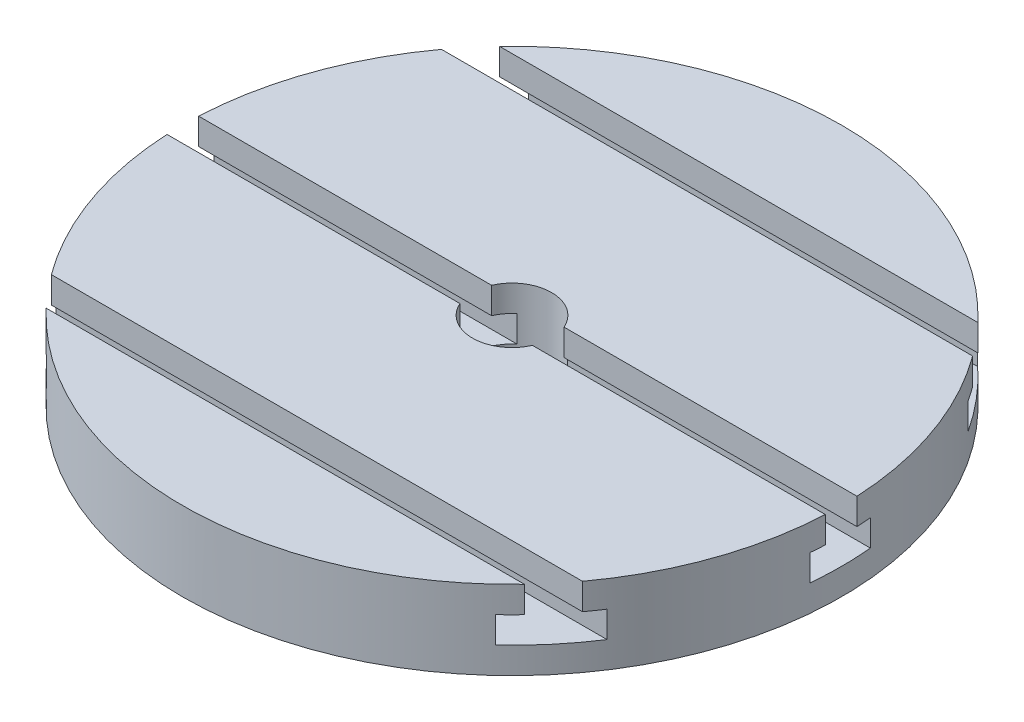
ISO-10303-21;
HEADER;
FILE_DESCRIPTION(('STEP AP214'),'2;1');
FILE_NAME('part.step','',(''),(''),'','','');
FILE_SCHEMA(('AUTOMOTIVE_DESIGN { 1 0 10303 214 1 1 1 1 }'));
ENDSEC;
DATA;
#1=APPLICATION_CONTEXT('core data for automotive mechanical design processes');
#2=APPLICATION_PROTOCOL_DEFINITION('international standard','automotive_design',2000,#1);
#3=PRODUCT_CONTEXT('',#1,'mechanical');
#4=PRODUCT('Part','Part','',(#3));
#5=PRODUCT_RELATED_PRODUCT_CATEGORY('part','',(#4));
#6=PRODUCT_DEFINITION_FORMATION('','',#4);
#7=PRODUCT_DEFINITION_CONTEXT('part definition',#1,'design');
#8=PRODUCT_DEFINITION('design','',#6,#7);
#9=PRODUCT_DEFINITION_SHAPE('','',#8);
#10=(LENGTH_UNIT() NAMED_UNIT(*) SI_UNIT(.MILLI.,.METRE.));
#11=(NAMED_UNIT(*) PLANE_ANGLE_UNIT() SI_UNIT($,.RADIAN.));
#12=(NAMED_UNIT(*) SI_UNIT($,.STERADIAN.) SOLID_ANGLE_UNIT());
#13=UNCERTAINTY_MEASURE_WITH_UNIT(LENGTH_MEASURE(1.E-05),#10,'distance_accuracy_value','');
#14=(GEOMETRIC_REPRESENTATION_CONTEXT(3) GLOBAL_UNCERTAINTY_ASSIGNED_CONTEXT((#13)) GLOBAL_UNIT_ASSIGNED_CONTEXT((#10,
#11,#12)) REPRESENTATION_CONTEXT('',''));
#15=CARTESIAN_POINT('',(0.,0.,0.));
#16=DIRECTION('',(0.,0.,1.));
#17=DIRECTION('',(1.,0.,0.));
#18=AXIS2_PLACEMENT_3D('',#15,#16,#17);
#19=CARTESIAN_POINT('',(0.,30.,-15.));
#20=DIRECTION('',(0.,1.,0.));
#21=DIRECTION('',(0.,0.,1.));
#22=AXIS2_PLACEMENT_3D('',#19,#20,#21);
#23=PLANE('',#22);
#24=DIRECTION('',(1.,0.,0.));
#25=VECTOR('',#24,1.);
#26=CARTESIAN_POINT('',(-150.,29.9999999999994,86.));
#27=LINE('',#26,#25);
#28=CARTESIAN_POINT('',(-90.7138357694128,29.9999999999994,86.));
#29=VERTEX_POINT('',#28);
#30=CARTESIAN_POINT('',(90.7138357694128,29.9999999999994,86.));
#31=VERTEX_POINT('',#30);
#32=EDGE_CURVE('E378',#29,#31,#27,.T.);
#33=ORIENTED_EDGE('',*,*,#32,.F.);
#34=CARTESIAN_POINT('',(0.,30.,0.));
#35=DIRECTION('',(0.,-1.,0.));
#36=DIRECTION('',(0.,0.,-1.));
#37=AXIS2_PLACEMENT_3D('',#34,#35,#36);
#38=CIRCLE('',#37,125.);
#39=EDGE_CURVE('E469',#31,#29,#38,.T.);
#40=ORIENTED_EDGE('',*,*,#39,.F.);
#41=EDGE_LOOP('',(#33,#40));
#42=FACE_BOUND('',#41,.T.);
#43=ADVANCED_FACE('F35',(#42),#23,.T.);
#44=DIRECTION('',(1.,0.,0.));
#45=VECTOR('',#44,1.);
#46=CARTESIAN_POINT('',(-150.,30.,-74.));
#47=LINE('',#46,#45);
#48=CARTESIAN_POINT('',(-100.742245359134,30.,-74.));
#49=VERTEX_POINT('',#48);
#50=CARTESIAN_POINT('',(100.742245359134,30.,-74.));
#51=VERTEX_POINT('',#50);
#52=EDGE_CURVE('E466',#49,#51,#47,.T.);
#53=ORIENTED_EDGE('',*,*,#52,.F.);
#54=CARTESIAN_POINT('',(-124.855916960311,30.,-6.));
#55=VERTEX_POINT('',#54);
#56=EDGE_CURVE('E446',#55,#49,#38,.T.);
#57=ORIENTED_EDGE('',*,*,#56,.F.);
#58=DIRECTION('',(1.,0.,0.));
#59=VECTOR('',#58,1.);
#60=CARTESIAN_POINT('',(-150.,30.,-6.));
#61=LINE('',#60,#59);
#62=CARTESIAN_POINT('',(-13.7477270848675,30.,-6.));
#63=VERTEX_POINT('',#62);
#64=EDGE_CURVE('E404',#55,#63,#61,.T.);
#65=ORIENTED_EDGE('',*,*,#64,.T.);
#66=CARTESIAN_POINT('',(0.,30.,0.));
#67=DIRECTION('',(0.,-1.,0.));
#68=DIRECTION('',(0.,0.,-1.));
#69=AXIS2_PLACEMENT_3D('',#66,#67,#68);
#70=CIRCLE('',#69,15.);
#71=CARTESIAN_POINT('',(13.7477270848675,30.,-6.));
#72=VERTEX_POINT('',#71);
#73=EDGE_CURVE('E448',#63,#72,#70,.T.);
#74=ORIENTED_EDGE('',*,*,#73,.T.);
#75=CARTESIAN_POINT('',(124.855916960311,30.,-6.));
#76=VERTEX_POINT('',#75);
#77=EDGE_CURVE('E405',#72,#76,#61,.T.);
#78=ORIENTED_EDGE('',*,*,#77,.T.);
#79=EDGE_CURVE('E447',#51,#76,#38,.T.);
#80=ORIENTED_EDGE('',*,*,#79,.F.);
#81=EDGE_LOOP('',(#53,#57,#65,#74,#78,#80));
#82=FACE_BOUND('',#81,.T.);
#83=ADVANCED_FACE('F463',(#82),#23,.T.);
#84=DIRECTION('',(1.,0.,0.));
#85=VECTOR('',#84,1.);
#86=CARTESIAN_POINT('',(-150.,29.9999999999994,74.));
#87=LINE('',#86,#85);
#88=CARTESIAN_POINT('',(-100.742245359134,29.9999999999994,74.));
#89=VERTEX_POINT('',#88);
#90=CARTESIAN_POINT('',(100.742245359134,29.9999999999994,74.));
#91=VERTEX_POINT('',#90);
#92=EDGE_CURVE('E381',#89,#91,#87,.T.);
#93=ORIENTED_EDGE('',*,*,#92,.T.);
#94=CARTESIAN_POINT('',(124.855916960311,30.,6.));
#95=VERTEX_POINT('',#94);
#96=EDGE_CURVE('E473',#95,#91,#38,.T.);
#97=ORIENTED_EDGE('',*,*,#96,.F.);
#98=DIRECTION('',(1.,0.,0.));
#99=VECTOR('',#98,1.);
#100=CARTESIAN_POINT('',(-150.,30.,6.));
#101=LINE('',#100,#99);
#102=CARTESIAN_POINT('',(13.7477270848675,30.,6.));
#103=VERTEX_POINT('',#102);
#104=EDGE_CURVE('E402',#103,#95,#101,.T.);
#105=ORIENTED_EDGE('',*,*,#104,.F.);
#106=CARTESIAN_POINT('',(-13.7477270848675,30.,6.));
#107=VERTEX_POINT('',#106);
#108=EDGE_CURVE('E255',#103,#107,#70,.T.);
#109=ORIENTED_EDGE('',*,*,#108,.T.);
#110=CARTESIAN_POINT('',(-124.855916960311,30.,6.));
#111=VERTEX_POINT('',#110);
#112=EDGE_CURVE('E401',#111,#107,#101,.T.);
#113=ORIENTED_EDGE('',*,*,#112,.F.);
#114=EDGE_CURVE('E467',#89,#111,#38,.T.);
#115=ORIENTED_EDGE('',*,*,#114,.F.);
#116=EDGE_LOOP('',(#93,#97,#105,#109,#113,#115));
#117=FACE_BOUND('',#116,.T.);
#118=ADVANCED_FACE('F522',(#117),#23,.T.);
#119=CARTESIAN_POINT('',(0.,-12.6281159376769,0.));
#120=DIRECTION('',(0.,-1.,0.));
#121=DIRECTION('',(0.,0.,-1.));
#122=AXIS2_PLACEMENT_3D('',#119,#120,#121);
#123=CYLINDRICAL_SURFACE('',#122,15.);
#124=DIRECTION('',(0.,-1.,0.));
#125=VECTOR('',#124,1.);
#126=CARTESIAN_POINT('',(13.7477270848675,-12.6281159376769,5.99999999999999));
#127=LINE('',#126,#125);
#128=CARTESIAN_POINT('',(13.7477270848675,20.,6.));
#129=VERTEX_POINT('',#128);
#130=EDGE_CURVE('E424',#129,#103,#127,.F.);
#131=ORIENTED_EDGE('',*,*,#130,.F.);
#132=CARTESIAN_POINT('',(0.,20.,0.));
#133=DIRECTION('',(0.,1.,0.));
#134=DIRECTION('',(0.,0.,1.));
#135=AXIS2_PLACEMENT_3D('',#132,#133,#134);
#136=CIRCLE('',#135,15.);
#137=CARTESIAN_POINT('',(9.63068014212911,20.,11.5));
#138=VERTEX_POINT('',#137);
#139=EDGE_CURVE('E430',#138,#129,#136,.T.);
#140=ORIENTED_EDGE('',*,*,#139,.F.);
#141=DIRECTION('',(0.,-1.,0.));
#142=VECTOR('',#141,1.);
#143=CARTESIAN_POINT('',(9.63068014212912,-12.6281159376769,11.5));
#144=LINE('',#143,#142);
#145=CARTESIAN_POINT('',(9.63068014212912,9.99999999999997,11.5));
#146=VERTEX_POINT('',#145);
#147=EDGE_CURVE('E431',#146,#138,#144,.F.);
#148=ORIENTED_EDGE('',*,*,#147,.F.);
#149=CARTESIAN_POINT('',(0.,9.99999999999997,0.));
#150=DIRECTION('',(0.,-1.,0.));
#151=DIRECTION('',(0.,0.,-1.));
#152=AXIS2_PLACEMENT_3D('',#149,#150,#151);
#153=CIRCLE('',#152,15.);
#154=CARTESIAN_POINT('',(9.63068014212912,9.99999999999997,-11.5));
#155=VERTEX_POINT('',#154);
#156=EDGE_CURVE('E436',#155,#146,#153,.T.);
#157=ORIENTED_EDGE('',*,*,#156,.F.);
#158=DIRECTION('',(0.,-1.,0.));
#159=VECTOR('',#158,1.);
#160=CARTESIAN_POINT('',(9.63068014212912,-12.6281159376769,-11.5));
#161=LINE('',#160,#159);
#162=CARTESIAN_POINT('',(9.63068014212912,20.,-11.5));
#163=VERTEX_POINT('',#162);
#164=EDGE_CURVE('E415',#163,#155,#161,.T.);
#165=ORIENTED_EDGE('',*,*,#164,.F.);
#166=CARTESIAN_POINT('',(0.,20.,0.));
#167=DIRECTION('',(0.,1.,0.));
#168=DIRECTION('',(0.,0.,1.));
#169=AXIS2_PLACEMENT_3D('',#166,#167,#168);
#170=CIRCLE('',#169,15.);
#171=CARTESIAN_POINT('',(13.7477270848675,20.,-6.));
#172=VERTEX_POINT('',#171);
#173=EDGE_CURVE('E419',#172,#163,#170,.T.);
#174=ORIENTED_EDGE('',*,*,#173,.F.);
#175=DIRECTION('',(0.,-1.,0.));
#176=VECTOR('',#175,1.);
#177=CARTESIAN_POINT('',(13.7477270848675,-12.6281159376769,-6.));
#178=LINE('',#177,#176);
#179=EDGE_CURVE('E422',#72,#172,#178,.T.);
#180=ORIENTED_EDGE('',*,*,#179,.F.);
#181=ORIENTED_EDGE('',*,*,#73,.F.);
#182=DIRECTION('',(0.,-1.,0.));
#183=VECTOR('',#182,1.);
#184=CARTESIAN_POINT('',(-13.7477270848675,-12.6281159376769,-6.));
#185=LINE('',#184,#183);
#186=CARTESIAN_POINT('',(-13.7477270848675,20.,-6.));
#187=VERTEX_POINT('',#186);
#188=EDGE_CURVE('E420',#187,#63,#185,.F.);
#189=ORIENTED_EDGE('',*,*,#188,.F.);
#190=CARTESIAN_POINT('',(-9.63068014212912,20.,-11.5));
#191=VERTEX_POINT('',#190);
#192=EDGE_CURVE('E417',#191,#187,#170,.T.);
#193=ORIENTED_EDGE('',*,*,#192,.F.);
#194=DIRECTION('',(0.,-1.,0.));
#195=VECTOR('',#194,1.);
#196=CARTESIAN_POINT('',(-9.63068014212912,-12.6281159376769,-11.5));
#197=LINE('',#196,#195);
#198=CARTESIAN_POINT('',(-9.63068014212912,9.99999999999997,-11.5));
#199=VERTEX_POINT('',#198);
#200=EDGE_CURVE('E413',#199,#191,#197,.F.);
#201=ORIENTED_EDGE('',*,*,#200,.F.);
#202=CARTESIAN_POINT('',(-9.63068014212912,9.99999999999997,11.5));
#203=VERTEX_POINT('',#202);
#204=EDGE_CURVE('E263',#203,#199,#153,.T.);
#205=ORIENTED_EDGE('',*,*,#204,.F.);
#206=DIRECTION('',(0.,-1.,0.));
#207=VECTOR('',#206,1.);
#208=CARTESIAN_POINT('',(-9.63068014212912,-12.6281159376769,11.5));
#209=LINE('',#208,#207);
#210=CARTESIAN_POINT('',(-9.63068014212911,20.,11.5));
#211=VERTEX_POINT('',#210);
#212=EDGE_CURVE('E433',#211,#203,#209,.T.);
#213=ORIENTED_EDGE('',*,*,#212,.F.);
#214=CARTESIAN_POINT('',(-13.7477270848675,20.,6.));
#215=VERTEX_POINT('',#214);
#216=EDGE_CURVE('E428',#215,#211,#136,.T.);
#217=ORIENTED_EDGE('',*,*,#216,.F.);
#218=DIRECTION('',(0.,-1.,0.));
#219=VECTOR('',#218,1.);
#220=CARTESIAN_POINT('',(-13.7477270848675,-12.6281159376769,5.99999999999999));
#221=LINE('',#220,#219);
#222=EDGE_CURVE('E426',#107,#215,#221,.T.);
#223=ORIENTED_EDGE('',*,*,#222,.F.);
#224=ORIENTED_EDGE('',*,*,#108,.F.);
#225=EDGE_LOOP('',(#131,#140,#148,#157,#165,#174,#180,#181,#189,#193,#201,#205,#213,#217,#223,#224));
#226=FACE_BOUND('',#225,.T.);
#227=CARTESIAN_POINT('',(0.,0.,0.));
#228=DIRECTION('',(0.,-1.,0.));
#229=DIRECTION('',(0.,0.,-1.));
#230=AXIS2_PLACEMENT_3D('',#227,#228,#229);
#231=CIRCLE('',#230,15.);
#232=CARTESIAN_POINT('',(0.,0.,-15.));
#233=VERTEX_POINT('',#232);
#234=EDGE_CURVE('E437',#233,#233,#231,.T.);
#235=ORIENTED_EDGE('',*,*,#234,.T.);
#236=EDGE_LOOP('',(#235));
#237=FACE_BOUND('',#236,.T.);
#238=ADVANCED_FACE('F37',(#226,#237),#123,.F.);
#239=DIRECTION('',(1.,0.,0.));
#240=VECTOR('',#239,1.);
#241=CARTESIAN_POINT('',(-150.,30.,-86.));
#242=LINE('',#241,#240);
#243=CARTESIAN_POINT('',(-90.7138357694128,30.,-86.));
#244=VERTEX_POINT('',#243);
#245=CARTESIAN_POINT('',(90.7138357694128,30.,-86.));
#246=VERTEX_POINT('',#245);
#247=EDGE_CURVE('E859',#244,#246,#242,.T.);
#248=ORIENTED_EDGE('',*,*,#247,.T.);
#249=EDGE_CURVE('E443',#244,#246,#38,.T.);
#250=ORIENTED_EDGE('',*,*,#249,.F.);
#251=EDGE_LOOP('',(#248,#250));
#252=FACE_BOUND('',#251,.T.);
#253=ADVANCED_FACE('F535',(#252),#23,.T.);
#254=CARTESIAN_POINT('',(0.,-12.6281159376769,0.));
#255=DIRECTION('',(0.,-1.,0.));
#256=DIRECTION('',(0.,0.,-1.));
#257=AXIS2_PLACEMENT_3D('',#254,#255,#256);
#258=CYLINDRICAL_SURFACE('',#257,125.);
#259=DIRECTION('',(0.,-1.,0.));
#260=VECTOR('',#259,1.);
#261=CARTESIAN_POINT('',(-90.7138357694129,-12.628115937677,86.));
#262=LINE('',#261,#260);
#263=CARTESIAN_POINT('',(-90.7138357694129,19.9999999999994,86.));
#264=VERTEX_POINT('',#263);
#265=EDGE_CURVE('E11',#264,#29,#262,.F.);
#266=ORIENTED_EDGE('',*,*,#265,.F.);
#267=CARTESIAN_POINT('',(0.,19.9999999999995,0.));
#268=DIRECTION('',(0.,1.,0.));
#269=DIRECTION('',(0.,0.,1.));
#270=AXIS2_PLACEMENT_3D('',#267,#268,#269);
#271=CIRCLE('',#270,125.);
#272=CARTESIAN_POINT('',(-85.1630788546304,19.9999999999994,91.5));
#273=VERTEX_POINT('',#272);
#274=EDGE_CURVE('E43',#273,#264,#271,.F.);
#275=ORIENTED_EDGE('',*,*,#274,.F.);
#276=DIRECTION('',(0.,-1.,0.));
#277=VECTOR('',#276,1.);
#278=CARTESIAN_POINT('',(-85.1630788546304,-12.6281159376769,91.5));
#279=LINE('',#278,#277);
#280=CARTESIAN_POINT('',(-85.1630788546304,9.99999999999941,91.5));
#281=VERTEX_POINT('',#280);
#282=EDGE_CURVE('E346',#281,#273,#279,.F.);
#283=ORIENTED_EDGE('',*,*,#282,.F.);
#284=CARTESIAN_POINT('',(0.,9.99999999999942,0.));
#285=DIRECTION('',(0.,-1.,0.));
#286=DIRECTION('',(0.,0.,-1.));
#287=AXIS2_PLACEMENT_3D('',#284,#285,#286);
#288=CIRCLE('',#287,125.);
#289=CARTESIAN_POINT('',(-104.559791507061,9.99999999999941,68.5));
#290=VERTEX_POINT('',#289);
#291=EDGE_CURVE('E337',#290,#281,#288,.F.);
#292=ORIENTED_EDGE('',*,*,#291,.F.);
#293=DIRECTION('',(0.,-1.,0.));
#294=VECTOR('',#293,1.);
#295=CARTESIAN_POINT('',(-104.559791507061,-12.6281159376768,68.5));
#296=LINE('',#295,#294);
#297=CARTESIAN_POINT('',(-104.559791507061,19.9999999999994,68.5));
#298=VERTEX_POINT('',#297);
#299=EDGE_CURVE('E345',#298,#290,#296,.T.);
#300=ORIENTED_EDGE('',*,*,#299,.F.);
#301=CARTESIAN_POINT('',(0.,19.9999999999994,0.));
#302=DIRECTION('',(0.,1.,0.));
#303=DIRECTION('',(0.,0.,1.));
#304=AXIS2_PLACEMENT_3D('',#301,#302,#303);
#305=CIRCLE('',#304,125.);
#306=CARTESIAN_POINT('',(-100.742245359134,19.9999999999994,74.));
#307=VERTEX_POINT('',#306);
#308=EDGE_CURVE('E330',#307,#298,#305,.F.);
#309=ORIENTED_EDGE('',*,*,#308,.F.);
#310=DIRECTION('',(0.,-1.,0.));
#311=VECTOR('',#310,1.);
#312=CARTESIAN_POINT('',(-100.742245359134,-12.6281159376769,74.));
#313=LINE('',#312,#311);
#314=EDGE_CURVE('E343',#89,#307,#313,.T.);
#315=ORIENTED_EDGE('',*,*,#314,.F.);
#316=ORIENTED_EDGE('',*,*,#114,.T.);
#317=DIRECTION('',(0.,-1.,0.));
#318=VECTOR('',#317,1.);
#319=CARTESIAN_POINT('',(-124.855916960311,-12.6281159376769,5.99999999999999));
#320=LINE('',#319,#318);
#321=CARTESIAN_POINT('',(-124.855916960311,20.,6.));
#322=VERTEX_POINT('',#321);
#323=EDGE_CURVE('E498',#322,#111,#320,.F.);
#324=ORIENTED_EDGE('',*,*,#323,.F.);
#325=CARTESIAN_POINT('',(0.,20.,0.));
#326=DIRECTION('',(0.,1.,0.));
#327=DIRECTION('',(0.,0.,1.));
#328=AXIS2_PLACEMENT_3D('',#325,#326,#327);
#329=CIRCLE('',#328,125.);
#330=CARTESIAN_POINT('',(-124.469875873643,20.,11.5));
#331=VERTEX_POINT('',#330);
#332=EDGE_CURVE('E276',#331,#322,#329,.F.);
#333=ORIENTED_EDGE('',*,*,#332,.F.);
#334=DIRECTION('',(0.,-1.,0.));
#335=VECTOR('',#334,1.);
#336=CARTESIAN_POINT('',(-124.469875873643,-12.6281159376769,11.5));
#337=LINE('',#336,#335);
#338=CARTESIAN_POINT('',(-124.469875873643,9.99999999999997,11.5));
#339=VERTEX_POINT('',#338);
#340=EDGE_CURVE('E272',#339,#331,#337,.F.);
#341=ORIENTED_EDGE('',*,*,#340,.F.);
#342=CARTESIAN_POINT('',(0.,9.99999999999997,0.));
#343=DIRECTION('',(0.,-1.,0.));
#344=DIRECTION('',(0.,0.,-1.));
#345=AXIS2_PLACEMENT_3D('',#342,#343,#344);
#346=CIRCLE('',#345,125.);
#347=CARTESIAN_POINT('',(-124.469875873643,9.99999999999997,-11.5));
#348=VERTEX_POINT('',#347);
#349=EDGE_CURVE('E260',#348,#339,#346,.F.);
#350=ORIENTED_EDGE('',*,*,#349,.F.);
#351=DIRECTION('',(0.,-1.,0.));
#352=VECTOR('',#351,1.);
#353=CARTESIAN_POINT('',(-124.469875873643,-12.6281159376769,-11.5));
#354=LINE('',#353,#352);
#355=CARTESIAN_POINT('',(-124.469875873643,20.,-11.5));
#356=VERTEX_POINT('',#355);
#357=EDGE_CURVE('E243',#356,#348,#354,.T.);
#358=ORIENTED_EDGE('',*,*,#357,.F.);
#359=CARTESIAN_POINT('',(0.,20.,0.));
#360=DIRECTION('',(0.,1.,0.));
#361=DIRECTION('',(0.,0.,1.));
#362=AXIS2_PLACEMENT_3D('',#359,#360,#361);
#363=CIRCLE('',#362,125.);
#364=CARTESIAN_POINT('',(-124.855916960311,20.,-6.));
#365=VERTEX_POINT('',#364);
#366=EDGE_CURVE('E254',#365,#356,#363,.F.);
#367=ORIENTED_EDGE('',*,*,#366,.F.);
#368=DIRECTION('',(0.,-1.,0.));
#369=VECTOR('',#368,1.);
#370=CARTESIAN_POINT('',(-124.855916960311,-12.6281159376769,-6.));
#371=LINE('',#370,#369);
#372=EDGE_CURVE('E273',#55,#365,#371,.T.);
#373=ORIENTED_EDGE('',*,*,#372,.F.);
#374=ORIENTED_EDGE('',*,*,#56,.T.);
#375=DIRECTION('',(0.,-1.,0.));
#376=VECTOR('',#375,1.);
#377=CARTESIAN_POINT('',(-100.742245359134,-12.6281159376768,-74.0000000000001));
#378=LINE('',#377,#376);
#379=CARTESIAN_POINT('',(-100.742245359134,20.,-74.));
#380=VERTEX_POINT('',#379);
#381=EDGE_CURVE('E325',#380,#49,#378,.F.);
#382=ORIENTED_EDGE('',*,*,#381,.F.);
#383=CARTESIAN_POINT('',(0.,19.9999999999999,0.));
#384=DIRECTION('',(0.,1.,0.));
#385=DIRECTION('',(0.,0.,1.));
#386=AXIS2_PLACEMENT_3D('',#383,#384,#385);
#387=CIRCLE('',#386,125.);
#388=CARTESIAN_POINT('',(-104.559791507061,20.,-68.5));
#389=VERTEX_POINT('',#388);
#390=EDGE_CURVE('E317',#389,#380,#387,.F.);
#391=ORIENTED_EDGE('',*,*,#390,.F.);
#392=DIRECTION('',(0.,-1.,0.));
#393=VECTOR('',#392,1.);
#394=CARTESIAN_POINT('',(-104.559791507061,-12.6281159376769,-68.5));
#395=LINE('',#394,#393);
#396=CARTESIAN_POINT('',(-104.559791507061,9.99999999999997,-68.5));
#397=VERTEX_POINT('',#396);
#398=EDGE_CURVE('E323',#397,#389,#395,.F.);
#399=ORIENTED_EDGE('',*,*,#398,.F.);
#400=CARTESIAN_POINT('',(0.,9.99999999999996,0.));
#401=DIRECTION('',(0.,-1.,0.));
#402=DIRECTION('',(0.,0.,-1.));
#403=AXIS2_PLACEMENT_3D('',#400,#401,#402);
#404=CIRCLE('',#403,125.);
#405=CARTESIAN_POINT('',(-85.1630788546304,9.99999999999997,-91.5));
#406=VERTEX_POINT('',#405);
#407=EDGE_CURVE('E312',#406,#397,#404,.F.);
#408=ORIENTED_EDGE('',*,*,#407,.F.);
#409=DIRECTION('',(0.,-1.,0.));
#410=VECTOR('',#409,1.);
#411=CARTESIAN_POINT('',(-85.1630788546305,-12.628115937677,-91.5));
#412=LINE('',#411,#410);
#413=CARTESIAN_POINT('',(-85.1630788546304,20.,-91.5));
#414=VERTEX_POINT('',#413);
#415=EDGE_CURVE('E321',#414,#406,#412,.T.);
#416=ORIENTED_EDGE('',*,*,#415,.F.);
#417=CARTESIAN_POINT('',(0.,20.,0.));
#418=DIRECTION('',(0.,1.,0.));
#419=DIRECTION('',(0.,0.,1.));
#420=AXIS2_PLACEMENT_3D('',#417,#418,#419);
#421=CIRCLE('',#420,125.);
#422=CARTESIAN_POINT('',(-90.7138357694128,20.,-86.));
#423=VERTEX_POINT('',#422);
#424=EDGE_CURVE('E305',#423,#414,#421,.F.);
#425=ORIENTED_EDGE('',*,*,#424,.F.);
#426=DIRECTION('',(0.,-1.,0.));
#427=VECTOR('',#426,1.);
#428=CARTESIAN_POINT('',(-90.7138357694128,-12.6281159376769,-86.));
#429=LINE('',#428,#427);
#430=EDGE_CURVE('E319',#244,#423,#429,.T.);
#431=ORIENTED_EDGE('',*,*,#430,.F.);
#432=ORIENTED_EDGE('',*,*,#249,.T.);
#433=DIRECTION('',(0.,-1.,0.));
#434=VECTOR('',#433,1.);
#435=CARTESIAN_POINT('',(90.7138357694128,-12.6281159376769,-86.));
#436=LINE('',#435,#434);
#437=CARTESIAN_POINT('',(90.7138357694128,20.,-86.));
#438=VERTEX_POINT('',#437);
#439=EDGE_CURVE('E304',#438,#246,#436,.F.);
#440=ORIENTED_EDGE('',*,*,#439,.F.);
#441=CARTESIAN_POINT('',(85.1630788546304,20.,-91.5));
#442=VERTEX_POINT('',#441);
#443=EDGE_CURVE('E302',#442,#438,#421,.F.);
#444=ORIENTED_EDGE('',*,*,#443,.F.);
#445=DIRECTION('',(0.,-1.,0.));
#446=VECTOR('',#445,1.);
#447=CARTESIAN_POINT('',(85.1630788546305,-12.628115937677,-91.5));
#448=LINE('',#447,#446);
#449=CARTESIAN_POINT('',(85.1630788546304,9.99999999999997,-91.5));
#450=VERTEX_POINT('',#449);
#451=EDGE_CURVE('E307',#450,#442,#448,.F.);
#452=ORIENTED_EDGE('',*,*,#451,.F.);
#453=CARTESIAN_POINT('',(104.559791507061,9.99999999999997,-68.5));
#454=VERTEX_POINT('',#453);
#455=EDGE_CURVE('E309',#454,#450,#404,.F.);
#456=ORIENTED_EDGE('',*,*,#455,.F.);
#457=DIRECTION('',(0.,-1.,0.));
#458=VECTOR('',#457,1.);
#459=CARTESIAN_POINT('',(104.559791507061,-12.6281159376769,-68.5));
#460=LINE('',#459,#458);
#461=CARTESIAN_POINT('',(104.559791507061,20.,-68.5));
#462=VERTEX_POINT('',#461);
#463=EDGE_CURVE('E311',#462,#454,#460,.T.);
#464=ORIENTED_EDGE('',*,*,#463,.F.);
#465=CARTESIAN_POINT('',(100.742245359134,20.,-74.));
#466=VERTEX_POINT('',#465);
#467=EDGE_CURVE('E314',#466,#462,#387,.F.);
#468=ORIENTED_EDGE('',*,*,#467,.F.);
#469=DIRECTION('',(0.,-1.,0.));
#470=VECTOR('',#469,1.);
#471=CARTESIAN_POINT('',(100.742245359134,-12.6281159376768,-74.0000000000001));
#472=LINE('',#471,#470);
#473=EDGE_CURVE('E316',#51,#466,#472,.T.);
#474=ORIENTED_EDGE('',*,*,#473,.F.);
#475=ORIENTED_EDGE('',*,*,#79,.T.);
#476=DIRECTION('',(0.,-1.,0.));
#477=VECTOR('',#476,1.);
#478=CARTESIAN_POINT('',(124.855916960311,-12.6281159376769,-6.));
#479=LINE('',#478,#477);
#480=CARTESIAN_POINT('',(124.855916960311,20.,-6.));
#481=VERTEX_POINT('',#480);
#482=EDGE_CURVE('E281',#481,#76,#479,.F.);
#483=ORIENTED_EDGE('',*,*,#482,.F.);
#484=CARTESIAN_POINT('',(124.469875873643,20.,-11.5));
#485=VERTEX_POINT('',#484);
#486=EDGE_CURVE('E289',#485,#481,#363,.F.);
#487=ORIENTED_EDGE('',*,*,#486,.F.);
#488=DIRECTION('',(0.,-1.,0.));
#489=VECTOR('',#488,1.);
#490=CARTESIAN_POINT('',(124.469875873643,-12.6281159376769,-11.5));
#491=LINE('',#490,#489);
#492=CARTESIAN_POINT('',(124.469875873643,9.99999999999997,-11.5));
#493=VERTEX_POINT('',#492);
#494=EDGE_CURVE('E295',#493,#485,#491,.F.);
#495=ORIENTED_EDGE('',*,*,#494,.F.);
#496=CARTESIAN_POINT('',(124.469875873643,9.99999999999997,11.5));
#497=VERTEX_POINT('',#496);
#498=EDGE_CURVE('E275',#497,#493,#346,.F.);
#499=ORIENTED_EDGE('',*,*,#498,.F.);
#500=DIRECTION('',(0.,-1.,0.));
#501=VECTOR('',#500,1.);
#502=CARTESIAN_POINT('',(124.469875873643,-12.6281159376769,11.5));
#503=LINE('',#502,#501);
#504=CARTESIAN_POINT('',(124.469875873643,20.,11.5));
#505=VERTEX_POINT('',#504);
#506=EDGE_CURVE('E280',#505,#497,#503,.T.);
#507=ORIENTED_EDGE('',*,*,#506,.F.);
#508=CARTESIAN_POINT('',(124.855916960311,20.,6.));
#509=VERTEX_POINT('',#508);
#510=EDGE_CURVE('E287',#509,#505,#329,.F.);
#511=ORIENTED_EDGE('',*,*,#510,.F.);
#512=DIRECTION('',(0.,-1.,0.));
#513=VECTOR('',#512,1.);
#514=CARTESIAN_POINT('',(124.855916960311,-12.6281159376769,5.99999999999999));
#515=LINE('',#514,#513);
#516=EDGE_CURVE('E300',#95,#509,#515,.T.);
#517=ORIENTED_EDGE('',*,*,#516,.F.);
#518=ORIENTED_EDGE('',*,*,#96,.T.);
#519=DIRECTION('',(0.,-1.,0.));
#520=VECTOR('',#519,1.);
#521=CARTESIAN_POINT('',(100.742245359134,-12.6281159376769,74.));
#522=LINE('',#521,#520);
#523=CARTESIAN_POINT('',(100.742245359134,19.9999999999994,74.));
#524=VERTEX_POINT('',#523);
#525=EDGE_CURVE('E329',#524,#91,#522,.F.);
#526=ORIENTED_EDGE('',*,*,#525,.F.);
#527=CARTESIAN_POINT('',(104.559791507061,19.9999999999994,68.5));
#528=VERTEX_POINT('',#527);
#529=EDGE_CURVE('E327',#528,#524,#305,.F.);
#530=ORIENTED_EDGE('',*,*,#529,.F.);
#531=DIRECTION('',(0.,-1.,0.));
#532=VECTOR('',#531,1.);
#533=CARTESIAN_POINT('',(104.559791507061,-12.6281159376768,68.5));
#534=LINE('',#533,#532);
#535=CARTESIAN_POINT('',(104.559791507061,9.99999999999941,68.5));
#536=VERTEX_POINT('',#535);
#537=EDGE_CURVE('E332',#536,#528,#534,.F.);
#538=ORIENTED_EDGE('',*,*,#537,.F.);
#539=CARTESIAN_POINT('',(85.1630788546305,9.99999999999941,91.5));
#540=VERTEX_POINT('',#539);
#541=EDGE_CURVE('E334',#540,#536,#288,.F.);
#542=ORIENTED_EDGE('',*,*,#541,.F.);
#543=DIRECTION('',(0.,-1.,0.));
#544=VECTOR('',#543,1.);
#545=CARTESIAN_POINT('',(85.1630788546304,-12.6281159376769,91.5));
#546=LINE('',#545,#544);
#547=CARTESIAN_POINT('',(85.1630788546304,19.9999999999994,91.5));
#548=VERTEX_POINT('',#547);
#549=EDGE_CURVE('E336',#548,#540,#546,.T.);
#550=ORIENTED_EDGE('',*,*,#549,.F.);
#551=CARTESIAN_POINT('',(90.7138357694129,19.9999999999994,86.));
#552=VERTEX_POINT('',#551);
#553=EDGE_CURVE('E339',#552,#548,#271,.F.);
#554=ORIENTED_EDGE('',*,*,#553,.F.);
#555=DIRECTION('',(0.,-1.,0.));
#556=VECTOR('',#555,1.);
#557=CARTESIAN_POINT('',(90.7138357694129,-12.628115937677,86.));
#558=LINE('',#557,#556);
#559=EDGE_CURVE('E341',#31,#552,#558,.T.);
#560=ORIENTED_EDGE('',*,*,#559,.F.);
#561=ORIENTED_EDGE('',*,*,#39,.T.);
#562=EDGE_LOOP('',(#266,#275,#283,#292,#300,#309,#315,#316,#324,#333,#341,#350,#358,#367,#373,
#374,#382,#391,#399,#408,#416,#425,#431,#432,#440,#444,#452,#456,#464,#468,#474,#475,#483,#487,
#495,#499,#507,#511,#517,#518,#526,#530,#538,#542,#550,#554,#560,#561));
#563=FACE_BOUND('',#562,.T.);
#564=CARTESIAN_POINT('',(0.,0.,0.));
#565=DIRECTION('',(0.,-1.,0.));
#566=DIRECTION('',(0.,0.,-1.));
#567=AXIS2_PLACEMENT_3D('',#564,#565,#566);
#568=CIRCLE('',#567,125.);
#569=CARTESIAN_POINT('',(0.,0.,-125.));
#570=VERTEX_POINT('',#569);
#571=EDGE_CURVE('E440',#570,#570,#568,.T.);
#572=ORIENTED_EDGE('',*,*,#571,.F.);
#573=EDGE_LOOP('',(#572));
#574=FACE_BOUND('',#573,.T.);
#575=ADVANCED_FACE('F269',(#563,#574),#258,.T.);
#576=CARTESIAN_POINT('',(0.,0.,-15.));
#577=DIRECTION('',(0.,-1.,0.));
#578=DIRECTION('',(0.,0.,-1.));
#579=AXIS2_PLACEMENT_3D('',#576,#577,#578);
#580=PLANE('',#579);
#581=ORIENTED_EDGE('',*,*,#571,.T.);
#582=EDGE_LOOP('',(#581));
#583=FACE_BOUND('',#582,.T.);
#584=ORIENTED_EDGE('',*,*,#234,.F.);
#585=EDGE_LOOP('',(#584));
#586=FACE_BOUND('',#585,.T.);
#587=ADVANCED_FACE('F546',(#583,#586),#580,.T.);
#588=CARTESIAN_POINT('',(-150.,9.99999999999997,-11.5));
#589=DIRECTION('',(0.,0.,-1.));
#590=DIRECTION('',(0.,1.,0.));
#591=AXIS2_PLACEMENT_3D('',#588,#589,#590);
#592=PLANE('',#591);
#593=ORIENTED_EDGE('',*,*,#200,.T.);
#594=DIRECTION('',(1.,0.,0.));
#595=VECTOR('',#594,1.);
#596=CARTESIAN_POINT('',(-150.,20.,-11.5));
#597=LINE('',#596,#595);
#598=EDGE_CURVE('E249',#356,#191,#597,.T.);
#599=ORIENTED_EDGE('',*,*,#598,.F.);
#600=ORIENTED_EDGE('',*,*,#357,.T.);
#601=DIRECTION('',(1.,0.,0.));
#602=VECTOR('',#601,1.);
#603=CARTESIAN_POINT('',(-150.,9.99999999999997,-11.5));
#604=LINE('',#603,#602);
#605=EDGE_CURVE('E246',#348,#199,#604,.T.);
#606=ORIENTED_EDGE('',*,*,#605,.T.);
#607=EDGE_LOOP('',(#593,#599,#600,#606));
#608=FACE_BOUND('',#607,.T.);
#609=ADVANCED_FACE('F245',(#608),#592,.F.);
#610=CARTESIAN_POINT('',(-150.,20.,-11.5));
#611=DIRECTION('',(0.,1.,0.));
#612=DIRECTION('',(0.,0.,1.));
#613=AXIS2_PLACEMENT_3D('',#610,#611,#612);
#614=PLANE('',#613);
#615=ORIENTED_EDGE('',*,*,#192,.T.);
#616=DIRECTION('',(1.,0.,0.));
#617=VECTOR('',#616,1.);
#618=CARTESIAN_POINT('',(-150.,20.,-6.));
#619=LINE('',#618,#617);
#620=EDGE_CURVE('E407',#365,#187,#619,.T.);
#621=ORIENTED_EDGE('',*,*,#620,.F.);
#622=ORIENTED_EDGE('',*,*,#366,.T.);
#623=ORIENTED_EDGE('',*,*,#598,.T.);
#624=EDGE_LOOP('',(#615,#621,#622,#623));
#625=FACE_BOUND('',#624,.T.);
#626=ADVANCED_FACE('F452',(#625),#614,.F.);
#627=CARTESIAN_POINT('',(-150.,20.,-6.));
#628=DIRECTION('',(0.,0.,-1.));
#629=DIRECTION('',(-1.,0.,0.));
#630=AXIS2_PLACEMENT_3D('',#627,#628,#629);
#631=PLANE('',#630);
#632=ORIENTED_EDGE('',*,*,#188,.T.);
#633=ORIENTED_EDGE('',*,*,#64,.F.);
#634=ORIENTED_EDGE('',*,*,#372,.T.);
#635=ORIENTED_EDGE('',*,*,#620,.T.);
#636=EDGE_LOOP('',(#632,#633,#634,#635));
#637=FACE_BOUND('',#636,.T.);
#638=ADVANCED_FACE('F587',(#637),#631,.F.);
#639=CARTESIAN_POINT('',(-150.,20.,6.));
#640=DIRECTION('',(0.,0.,1.));
#641=DIRECTION('',(0.,-1.,0.));
#642=AXIS2_PLACEMENT_3D('',#639,#640,#641);
#643=PLANE('',#642);
#644=ORIENTED_EDGE('',*,*,#222,.T.);
#645=DIRECTION('',(1.,0.,0.));
#646=VECTOR('',#645,1.);
#647=CARTESIAN_POINT('',(-150.,20.,6.));
#648=LINE('',#647,#646);
#649=EDGE_CURVE('E397',#322,#215,#648,.T.);
#650=ORIENTED_EDGE('',*,*,#649,.F.);
#651=ORIENTED_EDGE('',*,*,#323,.T.);
#652=ORIENTED_EDGE('',*,*,#112,.T.);
#653=EDGE_LOOP('',(#644,#650,#651,#652));
#654=FACE_BOUND('',#653,.T.);
#655=ADVANCED_FACE('F596',(#654),#643,.F.);
#656=CARTESIAN_POINT('',(-150.,20.,11.5));
#657=DIRECTION('',(0.,1.,0.));
#658=DIRECTION('',(0.,0.,1.));
#659=AXIS2_PLACEMENT_3D('',#656,#657,#658);
#660=PLANE('',#659);
#661=ORIENTED_EDGE('',*,*,#216,.T.);
#662=DIRECTION('',(1.,0.,0.));
#663=VECTOR('',#662,1.);
#664=CARTESIAN_POINT('',(-150.,20.,11.5));
#665=LINE('',#664,#663);
#666=EDGE_CURVE('E393',#331,#211,#665,.T.);
#667=ORIENTED_EDGE('',*,*,#666,.F.);
#668=ORIENTED_EDGE('',*,*,#332,.T.);
#669=ORIENTED_EDGE('',*,*,#649,.T.);
#670=EDGE_LOOP('',(#661,#667,#668,#669));
#671=FACE_BOUND('',#670,.T.);
#672=ADVANCED_FACE('F605',(#671),#660,.F.);
#673=CARTESIAN_POINT('',(-150.,9.99999999999997,11.5));
#674=DIRECTION('',(0.,0.,1.));
#675=DIRECTION('',(0.,-1.,0.));
#676=AXIS2_PLACEMENT_3D('',#673,#674,#675);
#677=PLANE('',#676);
#678=ORIENTED_EDGE('',*,*,#212,.T.);
#679=DIRECTION('',(1.,0.,0.));
#680=VECTOR('',#679,1.);
#681=CARTESIAN_POINT('',(-150.,9.99999999999997,11.5));
#682=LINE('',#681,#680);
#683=EDGE_CURVE('E392',#339,#203,#682,.T.);
#684=ORIENTED_EDGE('',*,*,#683,.F.);
#685=ORIENTED_EDGE('',*,*,#340,.T.);
#686=ORIENTED_EDGE('',*,*,#666,.T.);
#687=EDGE_LOOP('',(#678,#684,#685,#686));
#688=FACE_BOUND('',#687,.T.);
#689=ADVANCED_FACE('F614',(#688),#677,.F.);
#690=CARTESIAN_POINT('',(-150.,9.99999999999997,11.5));
#691=DIRECTION('',(0.,-1.,0.));
#692=DIRECTION('',(0.,0.,-1.));
#693=AXIS2_PLACEMENT_3D('',#690,#691,#692);
#694=PLANE('',#693);
#695=ORIENTED_EDGE('',*,*,#204,.T.);
#696=ORIENTED_EDGE('',*,*,#605,.F.);
#697=ORIENTED_EDGE('',*,*,#349,.T.);
#698=ORIENTED_EDGE('',*,*,#683,.T.);
#699=EDGE_LOOP('',(#695,#696,#697,#698));
#700=FACE_BOUND('',#699,.T.);
#701=ADVANCED_FACE('F258',(#700),#694,.F.);
#702=ORIENTED_EDGE('',*,*,#156,.T.);
#703=EDGE_CURVE('E390',#146,#497,#682,.T.);
#704=ORIENTED_EDGE('',*,*,#703,.T.);
#705=ORIENTED_EDGE('',*,*,#498,.T.);
#706=EDGE_CURVE('E265',#155,#493,#604,.T.);
#707=ORIENTED_EDGE('',*,*,#706,.F.);
#708=EDGE_LOOP('',(#702,#704,#705,#707));
#709=FACE_BOUND('',#708,.T.);
#710=ADVANCED_FACE('F632',(#709),#694,.F.);
#711=ORIENTED_EDGE('',*,*,#139,.T.);
#712=EDGE_CURVE('E398',#129,#509,#648,.T.);
#713=ORIENTED_EDGE('',*,*,#712,.T.);
#714=ORIENTED_EDGE('',*,*,#510,.T.);
#715=EDGE_CURVE('E394',#138,#505,#665,.T.);
#716=ORIENTED_EDGE('',*,*,#715,.F.);
#717=EDGE_LOOP('',(#711,#713,#714,#716));
#718=FACE_BOUND('',#717,.T.);
#719=ADVANCED_FACE('F509',(#718),#660,.F.);
#720=ORIENTED_EDGE('',*,*,#179,.T.);
#721=EDGE_CURVE('E408',#172,#481,#619,.T.);
#722=ORIENTED_EDGE('',*,*,#721,.T.);
#723=ORIENTED_EDGE('',*,*,#482,.T.);
#724=ORIENTED_EDGE('',*,*,#77,.F.);
#725=EDGE_LOOP('',(#720,#722,#723,#724));
#726=FACE_BOUND('',#725,.T.);
#727=ADVANCED_FACE('F484',(#726),#631,.F.);
#728=ORIENTED_EDGE('',*,*,#173,.T.);
#729=EDGE_CURVE('E264',#163,#485,#597,.T.);
#730=ORIENTED_EDGE('',*,*,#729,.T.);
#731=ORIENTED_EDGE('',*,*,#486,.T.);
#732=ORIENTED_EDGE('',*,*,#721,.F.);
#733=EDGE_LOOP('',(#728,#730,#731,#732));
#734=FACE_BOUND('',#733,.T.);
#735=ADVANCED_FACE('F495',(#734),#614,.F.);
#736=ORIENTED_EDGE('',*,*,#164,.T.);
#737=ORIENTED_EDGE('',*,*,#706,.T.);
#738=ORIENTED_EDGE('',*,*,#494,.T.);
#739=ORIENTED_EDGE('',*,*,#729,.F.);
#740=EDGE_LOOP('',(#736,#737,#738,#739));
#741=FACE_BOUND('',#740,.T.);
#742=ADVANCED_FACE('F497',(#741),#592,.F.);
#743=ORIENTED_EDGE('',*,*,#147,.T.);
#744=ORIENTED_EDGE('',*,*,#715,.T.);
#745=ORIENTED_EDGE('',*,*,#506,.T.);
#746=ORIENTED_EDGE('',*,*,#703,.F.);
#747=EDGE_LOOP('',(#743,#744,#745,#746));
#748=FACE_BOUND('',#747,.T.);
#749=ADVANCED_FACE('F514',(#748),#677,.F.);
#750=ORIENTED_EDGE('',*,*,#130,.T.);
#751=ORIENTED_EDGE('',*,*,#104,.T.);
#752=ORIENTED_EDGE('',*,*,#516,.T.);
#753=ORIENTED_EDGE('',*,*,#712,.F.);
#754=EDGE_LOOP('',(#750,#751,#752,#753));
#755=FACE_BOUND('',#754,.T.);
#756=ADVANCED_FACE('F519',(#755),#643,.F.);
#757=CARTESIAN_POINT('',(-150.,9.99999999999997,-91.5));
#758=DIRECTION('',(0.,0.,-1.));
#759=DIRECTION('',(0.,1.,0.));
#760=AXIS2_PLACEMENT_3D('',#757,#758,#759);
#761=PLANE('',#760);
#762=ORIENTED_EDGE('',*,*,#451,.T.);
#763=DIRECTION('',(1.,0.,0.));
#764=VECTOR('',#763,1.);
#765=CARTESIAN_POINT('',(-150.,20.,-91.5));
#766=LINE('',#765,#764);
#767=EDGE_CURVE('E58',#414,#442,#766,.T.);
#768=ORIENTED_EDGE('',*,*,#767,.F.);
#769=ORIENTED_EDGE('',*,*,#415,.T.);
#770=DIRECTION('',(1.,0.,0.));
#771=VECTOR('',#770,1.);
#772=CARTESIAN_POINT('',(-150.,9.99999999999997,-91.5));
#773=LINE('',#772,#771);
#774=EDGE_CURVE('E412',#406,#450,#773,.T.);
#775=ORIENTED_EDGE('',*,*,#774,.T.);
#776=EDGE_LOOP('',(#762,#768,#769,#775));
#777=FACE_BOUND('',#776,.T.);
#778=ADVANCED_FACE('F683',(#777),#761,.F.);
#779=CARTESIAN_POINT('',(-150.,9.99999999999997,-68.5));
#780=DIRECTION('',(0.,-1.,0.));
#781=DIRECTION('',(0.,0.,-1.));
#782=AXIS2_PLACEMENT_3D('',#779,#780,#781);
#783=PLANE('',#782);
#784=ORIENTED_EDGE('',*,*,#407,.T.);
#785=DIRECTION('',(1.,0.,0.));
#786=VECTOR('',#785,1.);
#787=CARTESIAN_POINT('',(-150.,9.99999999999997,-68.5));
#788=LINE('',#787,#786);
#789=EDGE_CURVE('E845',#397,#454,#788,.T.);
#790=ORIENTED_EDGE('',*,*,#789,.T.);
#791=ORIENTED_EDGE('',*,*,#455,.T.);
#792=ORIENTED_EDGE('',*,*,#774,.F.);
#793=EDGE_LOOP('',(#784,#790,#791,#792));
#794=FACE_BOUND('',#793,.T.);
#795=ADVANCED_FACE('F691',(#794),#783,.F.);
#796=CARTESIAN_POINT('',(-150.,9.99999999999997,-68.5));
#797=DIRECTION('',(0.,0.,1.));
#798=DIRECTION('',(1.,0.,0.));
#799=AXIS2_PLACEMENT_3D('',#796,#797,#798);
#800=PLANE('',#799);
#801=ORIENTED_EDGE('',*,*,#398,.T.);
#802=DIRECTION('',(1.,0.,0.));
#803=VECTOR('',#802,1.);
#804=CARTESIAN_POINT('',(-150.,20.,-68.5));
#805=LINE('',#804,#803);
#806=EDGE_CURVE('E850',#389,#462,#805,.T.);
#807=ORIENTED_EDGE('',*,*,#806,.T.);
#808=ORIENTED_EDGE('',*,*,#463,.T.);
#809=ORIENTED_EDGE('',*,*,#789,.F.);
#810=EDGE_LOOP('',(#801,#807,#808,#809));
#811=FACE_BOUND('',#810,.T.);
#812=ADVANCED_FACE('F701',(#811),#800,.F.);
#813=CARTESIAN_POINT('',(-150.,20.,-68.5));
#814=DIRECTION('',(0.,1.,0.));
#815=DIRECTION('',(0.,0.,1.));
#816=AXIS2_PLACEMENT_3D('',#813,#814,#815);
#817=PLANE('',#816);
#818=ORIENTED_EDGE('',*,*,#390,.T.);
#819=DIRECTION('',(1.,0.,0.));
#820=VECTOR('',#819,1.);
#821=CARTESIAN_POINT('',(-150.,20.,-74.));
#822=LINE('',#821,#820);
#823=EDGE_CURVE('E853',#380,#466,#822,.T.);
#824=ORIENTED_EDGE('',*,*,#823,.T.);
#825=ORIENTED_EDGE('',*,*,#467,.T.);
#826=ORIENTED_EDGE('',*,*,#806,.F.);
#827=EDGE_LOOP('',(#818,#824,#825,#826));
#828=FACE_BOUND('',#827,.T.);
#829=ADVANCED_FACE('F711',(#828),#817,.F.);
#830=CARTESIAN_POINT('',(-150.,20.,-74.));
#831=DIRECTION('',(0.,0.,1.));
#832=DIRECTION('',(0.,-1.,0.));
#833=AXIS2_PLACEMENT_3D('',#830,#831,#832);
#834=PLANE('',#833);
#835=ORIENTED_EDGE('',*,*,#381,.T.);
#836=ORIENTED_EDGE('',*,*,#52,.T.);
#837=ORIENTED_EDGE('',*,*,#473,.T.);
#838=ORIENTED_EDGE('',*,*,#823,.F.);
#839=EDGE_LOOP('',(#835,#836,#837,#838));
#840=FACE_BOUND('',#839,.T.);
#841=ADVANCED_FACE('F721',(#840),#834,.F.);
#842=CARTESIAN_POINT('',(-150.,20.,-86.));
#843=DIRECTION('',(0.,0.,-1.));
#844=DIRECTION('',(-1.,0.,0.));
#845=AXIS2_PLACEMENT_3D('',#842,#843,#844);
#846=PLANE('',#845);
#847=ORIENTED_EDGE('',*,*,#439,.T.);
#848=ORIENTED_EDGE('',*,*,#247,.F.);
#849=ORIENTED_EDGE('',*,*,#430,.T.);
#850=DIRECTION('',(1.,0.,0.));
#851=VECTOR('',#850,1.);
#852=CARTESIAN_POINT('',(-150.,20.,-86.));
#853=LINE('',#852,#851);
#854=EDGE_CURVE('E832',#423,#438,#853,.T.);
#855=ORIENTED_EDGE('',*,*,#854,.T.);
#856=EDGE_LOOP('',(#847,#848,#849,#855));
#857=FACE_BOUND('',#856,.T.);
#858=ADVANCED_FACE('F731',(#857),#846,.F.);
#859=CARTESIAN_POINT('',(-150.,20.,-91.5));
#860=DIRECTION('',(0.,1.,0.));
#861=DIRECTION('',(0.,0.,1.));
#862=AXIS2_PLACEMENT_3D('',#859,#860,#861);
#863=PLANE('',#862);
#864=ORIENTED_EDGE('',*,*,#424,.T.);
#865=ORIENTED_EDGE('',*,*,#767,.T.);
#866=ORIENTED_EDGE('',*,*,#443,.T.);
#867=ORIENTED_EDGE('',*,*,#854,.F.);
#868=EDGE_LOOP('',(#864,#865,#866,#867));
#869=FACE_BOUND('',#868,.T.);
#870=ADVANCED_FACE('F741',(#869),#863,.F.);
#871=CARTESIAN_POINT('',(-150.,9.99999999999941,68.5));
#872=DIRECTION('',(0.,0.,-1.));
#873=DIRECTION('',(0.,1.,0.));
#874=AXIS2_PLACEMENT_3D('',#871,#872,#873);
#875=PLANE('',#874);
#876=ORIENTED_EDGE('',*,*,#537,.T.);
#877=DIRECTION('',(1.,0.,0.));
#878=VECTOR('',#877,1.);
#879=CARTESIAN_POINT('',(-150.,19.9999999999994,68.5));
#880=LINE('',#879,#878);
#881=EDGE_CURVE('E50',#298,#528,#880,.T.);
#882=ORIENTED_EDGE('',*,*,#881,.F.);
#883=ORIENTED_EDGE('',*,*,#299,.T.);
#884=DIRECTION('',(1.,0.,0.));
#885=VECTOR('',#884,1.);
#886=CARTESIAN_POINT('',(-150.,9.99999999999941,68.5));
#887=LINE('',#886,#885);
#888=EDGE_CURVE('E360',#290,#536,#887,.T.);
#889=ORIENTED_EDGE('',*,*,#888,.T.);
#890=EDGE_LOOP('',(#876,#882,#883,#889));
#891=FACE_BOUND('',#890,.T.);
#892=ADVANCED_FACE('F530',(#891),#875,.F.);
#893=CARTESIAN_POINT('',(-150.,9.99999999999941,91.5));
#894=DIRECTION('',(0.,-1.,0.));
#895=DIRECTION('',(0.,0.,-1.));
#896=AXIS2_PLACEMENT_3D('',#893,#894,#895);
#897=PLANE('',#896);
#898=ORIENTED_EDGE('',*,*,#291,.T.);
#899=DIRECTION('',(1.,0.,0.));
#900=VECTOR('',#899,1.);
#901=CARTESIAN_POINT('',(-150.,9.99999999999941,91.5));
#902=LINE('',#901,#900);
#903=EDGE_CURVE('E357',#281,#540,#902,.T.);
#904=ORIENTED_EDGE('',*,*,#903,.T.);
#905=ORIENTED_EDGE('',*,*,#541,.T.);
#906=ORIENTED_EDGE('',*,*,#888,.F.);
#907=EDGE_LOOP('',(#898,#904,#905,#906));
#908=FACE_BOUND('',#907,.T.);
#909=ADVANCED_FACE('F356',(#908),#897,.F.);
#910=CARTESIAN_POINT('',(-150.,9.99999999999941,91.5));
#911=DIRECTION('',(0.,0.,1.));
#912=DIRECTION('',(1.,0.,0.));
#913=AXIS2_PLACEMENT_3D('',#910,#911,#912);
#914=PLANE('',#913);
#915=ORIENTED_EDGE('',*,*,#282,.T.);
#916=DIRECTION('',(1.,0.,0.));
#917=VECTOR('',#916,1.);
#918=CARTESIAN_POINT('',(-150.,19.9999999999994,91.5));
#919=LINE('',#918,#917);
#920=EDGE_CURVE('E364',#273,#548,#919,.T.);
#921=ORIENTED_EDGE('',*,*,#920,.T.);
#922=ORIENTED_EDGE('',*,*,#549,.T.);
#923=ORIENTED_EDGE('',*,*,#903,.F.);
#924=EDGE_LOOP('',(#915,#921,#922,#923));
#925=FACE_BOUND('',#924,.T.);
#926=ADVANCED_FACE('F362',(#925),#914,.F.);
#927=CARTESIAN_POINT('',(-150.,19.9999999999994,91.5));
#928=DIRECTION('',(0.,1.,0.));
#929=DIRECTION('',(0.,0.,1.));
#930=AXIS2_PLACEMENT_3D('',#927,#928,#929);
#931=PLANE('',#930);
#932=ORIENTED_EDGE('',*,*,#274,.T.);
#933=DIRECTION('',(1.,0.,0.));
#934=VECTOR('',#933,1.);
#935=CARTESIAN_POINT('',(-150.,19.9999999999994,86.));
#936=LINE('',#935,#934);
#937=EDGE_CURVE('E372',#264,#552,#936,.T.);
#938=ORIENTED_EDGE('',*,*,#937,.T.);
#939=ORIENTED_EDGE('',*,*,#553,.T.);
#940=ORIENTED_EDGE('',*,*,#920,.F.);
#941=EDGE_LOOP('',(#932,#938,#939,#940));
#942=FACE_BOUND('',#941,.T.);
#943=ADVANCED_FACE('F371',(#942),#931,.F.);
#944=CARTESIAN_POINT('',(-150.,19.9999999999994,86.));
#945=DIRECTION('',(0.,0.,1.));
#946=DIRECTION('',(0.,-1.,0.));
#947=AXIS2_PLACEMENT_3D('',#944,#945,#946);
#948=PLANE('',#947);
#949=ORIENTED_EDGE('',*,*,#265,.T.);
#950=ORIENTED_EDGE('',*,*,#32,.T.);
#951=ORIENTED_EDGE('',*,*,#559,.T.);
#952=ORIENTED_EDGE('',*,*,#937,.F.);
#953=EDGE_LOOP('',(#949,#950,#951,#952));
#954=FACE_BOUND('',#953,.T.);
#955=ADVANCED_FACE('F375',(#954),#948,.F.);
#956=CARTESIAN_POINT('',(-150.,19.9999999999994,74.));
#957=DIRECTION('',(0.,0.,-1.));
#958=DIRECTION('',(-1.,0.,0.));
#959=AXIS2_PLACEMENT_3D('',#956,#957,#958);
#960=PLANE('',#959);
#961=ORIENTED_EDGE('',*,*,#525,.T.);
#962=ORIENTED_EDGE('',*,*,#92,.F.);
#963=ORIENTED_EDGE('',*,*,#314,.T.);
#964=DIRECTION('',(1.,0.,0.));
#965=VECTOR('',#964,1.);
#966=CARTESIAN_POINT('',(-150.,19.9999999999994,74.));
#967=LINE('',#966,#965);
#968=EDGE_CURVE('E386',#307,#524,#967,.T.);
#969=ORIENTED_EDGE('',*,*,#968,.T.);
#970=EDGE_LOOP('',(#961,#962,#963,#969));
#971=FACE_BOUND('',#970,.T.);
#972=ADVANCED_FACE('F525',(#971),#960,.F.);
#973=CARTESIAN_POINT('',(-150.,19.9999999999994,68.5));
#974=DIRECTION('',(0.,1.,0.));
#975=DIRECTION('',(0.,0.,1.));
#976=AXIS2_PLACEMENT_3D('',#973,#974,#975);
#977=PLANE('',#976);
#978=ORIENTED_EDGE('',*,*,#308,.T.);
#979=ORIENTED_EDGE('',*,*,#881,.T.);
#980=ORIENTED_EDGE('',*,*,#529,.T.);
#981=ORIENTED_EDGE('',*,*,#968,.F.);
#982=EDGE_LOOP('',(#978,#979,#980,#981));
#983=FACE_BOUND('',#982,.T.);
#984=ADVANCED_FACE('F528',(#983),#977,.F.);
#985=CLOSED_SHELL('',(#43,#83,#118,#238,#253,#575,#587,#609,#626,#638,#655,#672,#689,#701,#710,
#719,#727,#735,#742,#749,#756,#778,#795,#812,#829,#841,#858,#870,#892,#909,#926,#943,#955,#972,#984));
#986=MANIFOLD_SOLID_BREP('B2',#985);
#987=ADVANCED_BREP_SHAPE_REPRESENTATION('',(#18,#986),#14);
#988=SHAPE_DEFINITION_REPRESENTATION(#9,#987);
ENDSEC;
END-ISO-10303-21;
